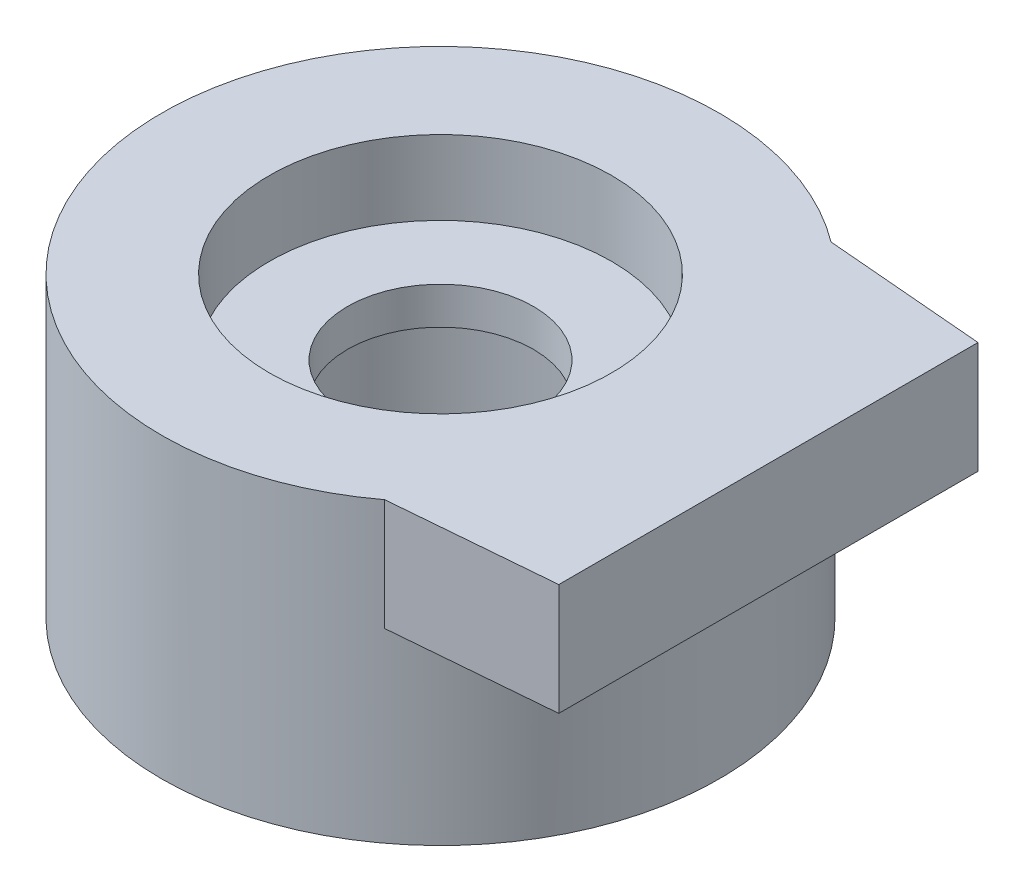
ISO-10303-21;
HEADER;
FILE_DESCRIPTION(('STEP AP214'),'2;1');
FILE_NAME('part.step','',(''),(''),'','','');
FILE_SCHEMA(('AUTOMOTIVE_DESIGN { 1 0 10303 214 1 1 1 1 }'));
ENDSEC;
DATA;
#1=APPLICATION_CONTEXT('core data for automotive mechanical design processes');
#2=APPLICATION_PROTOCOL_DEFINITION('international standard','automotive_design',2000,#1);
#3=PRODUCT_CONTEXT('',#1,'mechanical');
#4=PRODUCT('Part','Part','',(#3));
#5=PRODUCT_RELATED_PRODUCT_CATEGORY('part','',(#4));
#6=PRODUCT_DEFINITION_FORMATION('','',#4);
#7=PRODUCT_DEFINITION_CONTEXT('part definition',#1,'design');
#8=PRODUCT_DEFINITION('design','',#6,#7);
#9=PRODUCT_DEFINITION_SHAPE('','',#8);
#10=(LENGTH_UNIT() NAMED_UNIT(*) SI_UNIT(.MILLI.,.METRE.));
#11=(NAMED_UNIT(*) PLANE_ANGLE_UNIT() SI_UNIT($,.RADIAN.));
#12=(NAMED_UNIT(*) SI_UNIT($,.STERADIAN.) SOLID_ANGLE_UNIT());
#13=UNCERTAINTY_MEASURE_WITH_UNIT(LENGTH_MEASURE(1.E-05),#10,'distance_accuracy_value','');
#14=(GEOMETRIC_REPRESENTATION_CONTEXT(3) GLOBAL_UNCERTAINTY_ASSIGNED_CONTEXT((#13)) GLOBAL_UNIT_ASSIGNED_CONTEXT((#10,
#11,#12)) REPRESENTATION_CONTEXT('',''));
#15=CARTESIAN_POINT('',(0.,0.,0.));
#16=DIRECTION('',(0.,0.,1.));
#17=DIRECTION('',(1.,0.,0.));
#18=AXIS2_PLACEMENT_3D('',#15,#16,#17);
#19=CARTESIAN_POINT('',(0.,2.5,0.));
#20=DIRECTION('',(0.,-1.,0.));
#21=DIRECTION('',(0.,0.,-1.));
#22=AXIS2_PLACEMENT_3D('',#19,#20,#21);
#23=CYLINDRICAL_SURFACE('',#22,2.3);
#24=CARTESIAN_POINT('',(0.,0.,0.));
#25=DIRECTION('',(0.,-1.,0.));
#26=DIRECTION('',(0.,0.,-1.));
#27=AXIS2_PLACEMENT_3D('',#24,#25,#26);
#28=CIRCLE('',#27,2.3);
#29=CARTESIAN_POINT('',(0.,0.,-2.3));
#30=VERTEX_POINT('',#29);
#31=EDGE_CURVE('E11',#30,#30,#28,.T.);
#32=ORIENTED_EDGE('',*,*,#31,.T.);
#33=EDGE_LOOP('',(#32));
#34=FACE_BOUND('',#33,.T.);
#35=CARTESIAN_POINT('',(0.,2.5,0.));
#36=DIRECTION('',(0.,-1.,0.));
#37=DIRECTION('',(0.,0.,-1.));
#38=AXIS2_PLACEMENT_3D('',#35,#36,#37);
#39=CIRCLE('',#38,2.3);
#40=CARTESIAN_POINT('',(0.,2.5,-2.3));
#41=VERTEX_POINT('',#40);
#42=EDGE_CURVE('E72',#41,#41,#39,.T.);
#43=ORIENTED_EDGE('',*,*,#42,.F.);
#44=EDGE_LOOP('',(#43));
#45=FACE_BOUND('',#44,.T.);
#46=ADVANCED_FACE('F17',(#34,#45),#23,.F.);
#47=CARTESIAN_POINT('',(0.,3.,0.));
#48=DIRECTION('',(0.,1.,0.));
#49=DIRECTION('',(0.,0.,1.));
#50=AXIS2_PLACEMENT_3D('',#47,#48,#49);
#51=CYLINDRICAL_SURFACE('',#50,2.3);
#52=CARTESIAN_POINT('',(0.,4.,0.));
#53=DIRECTION('',(0.,1.,0.));
#54=DIRECTION('',(0.,0.,1.));
#55=AXIS2_PLACEMENT_3D('',#52,#53,#54);
#56=CIRCLE('',#55,2.3);
#57=CARTESIAN_POINT('',(0.,4.,2.3));
#58=VERTEX_POINT('',#57);
#59=EDGE_CURVE('E27',#58,#58,#56,.T.);
#60=ORIENTED_EDGE('',*,*,#59,.T.);
#61=EDGE_LOOP('',(#60));
#62=FACE_BOUND('',#61,.T.);
#63=CARTESIAN_POINT('',(0.,3.,0.));
#64=DIRECTION('',(0.,1.,0.));
#65=DIRECTION('',(0.,0.,1.));
#66=AXIS2_PLACEMENT_3D('',#63,#64,#65);
#67=CIRCLE('',#66,2.3);
#68=CARTESIAN_POINT('',(0.,3.,2.3));
#69=VERTEX_POINT('',#68);
#70=EDGE_CURVE('E90',#69,#69,#67,.T.);
#71=ORIENTED_EDGE('',*,*,#70,.F.);
#72=EDGE_LOOP('',(#71));
#73=FACE_BOUND('',#72,.T.);
#74=ADVANCED_FACE('F116',(#62,#73),#51,.F.);
#75=CARTESIAN_POINT('',(0.,4.,0.));
#76=DIRECTION('',(0.,-1.,0.));
#77=DIRECTION('',(0.,0.,-1.));
#78=AXIS2_PLACEMENT_3D('',#75,#76,#77);
#79=CYLINDRICAL_SURFACE('',#78,3.75);
#80=CARTESIAN_POINT('',(0.,0.,0.));
#81=DIRECTION('',(0.,1.,0.));
#82=DIRECTION('',(0.,0.,1.));
#83=AXIS2_PLACEMENT_3D('',#80,#81,#82);
#84=CIRCLE('',#83,3.75);
#85=CARTESIAN_POINT('',(0.,0.,3.75));
#86=VERTEX_POINT('',#85);
#87=EDGE_CURVE('E97',#86,#86,#84,.T.);
#88=ORIENTED_EDGE('',*,*,#87,.T.);
#89=EDGE_LOOP('',(#88));
#90=FACE_BOUND('',#89,.T.);
#91=CARTESIAN_POINT('',(0.,4.,0.));
#92=DIRECTION('',(0.,1.,0.));
#93=DIRECTION('',(0.,0.,1.));
#94=AXIS2_PLACEMENT_3D('',#91,#92,#93);
#95=CIRCLE('',#94,3.75);
#96=CARTESIAN_POINT('',(2.25,4.,-3.));
#97=VERTEX_POINT('',#96);
#98=CARTESIAN_POINT('',(2.25,4.,3.));
#99=VERTEX_POINT('',#98);
#100=EDGE_CURVE('E36',#97,#99,#95,.T.);
#101=ORIENTED_EDGE('',*,*,#100,.F.);
#102=DIRECTION('',(0.,1.,0.));
#103=VECTOR('',#102,1.);
#104=CARTESIAN_POINT('',(2.25,2.5,-3.));
#105=LINE('',#104,#103);
#106=CARTESIAN_POINT('',(2.25,2.5,-3.));
#107=VERTEX_POINT('',#106);
#108=EDGE_CURVE('E77',#107,#97,#105,.T.);
#109=ORIENTED_EDGE('',*,*,#108,.F.);
#110=CARTESIAN_POINT('',(0.,2.5,0.));
#111=DIRECTION('',(0.,-1.,0.));
#112=DIRECTION('',(0.,0.,-1.));
#113=AXIS2_PLACEMENT_3D('',#110,#111,#112);
#114=CIRCLE('',#113,3.75);
#115=CARTESIAN_POINT('',(2.25,2.5,3.));
#116=VERTEX_POINT('',#115);
#117=EDGE_CURVE('E99',#107,#116,#114,.T.);
#118=ORIENTED_EDGE('',*,*,#117,.T.);
#119=DIRECTION('',(0.,1.,0.));
#120=VECTOR('',#119,1.);
#121=CARTESIAN_POINT('',(2.25,2.5,3.));
#122=LINE('',#121,#120);
#123=EDGE_CURVE('E67',#116,#99,#122,.T.);
#124=ORIENTED_EDGE('',*,*,#123,.T.);
#125=EDGE_LOOP('',(#101,#109,#118,#124));
#126=FACE_BOUND('',#125,.T.);
#127=ADVANCED_FACE('F123',(#90,#126),#79,.T.);
#128=CARTESIAN_POINT('',(0.,-1.5,0.));
#129=DIRECTION('',(0.,1.,0.));
#130=DIRECTION('',(0.,0.,1.));
#131=AXIS2_PLACEMENT_3D('',#128,#129,#130);
#132=CYLINDRICAL_SURFACE('',#131,1.25);
#133=CARTESIAN_POINT('',(0.,3.,0.));
#134=DIRECTION('',(0.,1.,0.));
#135=DIRECTION('',(0.,0.,1.));
#136=AXIS2_PLACEMENT_3D('',#133,#134,#135);
#137=CIRCLE('',#136,1.25);
#138=CARTESIAN_POINT('',(0.,3.,1.25));
#139=VERTEX_POINT('',#138);
#140=EDGE_CURVE('E101',#139,#139,#137,.T.);
#141=ORIENTED_EDGE('',*,*,#140,.T.);
#142=EDGE_LOOP('',(#141));
#143=FACE_BOUND('',#142,.T.);
#144=CARTESIAN_POINT('',(0.,2.5,0.));
#145=DIRECTION('',(0.,1.,0.));
#146=DIRECTION('',(0.,0.,-1.));
#147=AXIS2_PLACEMENT_3D('',#144,#145,#146);
#148=CIRCLE('',#147,1.25);
#149=CARTESIAN_POINT('',(0.,2.5,-1.25));
#150=VERTEX_POINT('',#149);
#151=EDGE_CURVE('E81',#150,#150,#148,.T.);
#152=ORIENTED_EDGE('',*,*,#151,.F.);
#153=EDGE_LOOP('',(#152));
#154=FACE_BOUND('',#153,.T.);
#155=ADVANCED_FACE('F129',(#143,#154),#132,.F.);
#156=CARTESIAN_POINT('',(0.,4.,0.));
#157=DIRECTION('',(0.,1.,0.));
#158=DIRECTION('',(0.,0.,1.));
#159=AXIS2_PLACEMENT_3D('',#156,#157,#158);
#160=PLANE('',#159);
#161=DIRECTION('',(0.,0.,1.));
#162=VECTOR('',#161,1.);
#163=CARTESIAN_POINT('',(4.40776789419964,4.,2.81766907451634));
#164=LINE('',#163,#162);
#165=CARTESIAN_POINT('',(4.40776789419964,4.,-2.81766907451634));
#166=VERTEX_POINT('',#165);
#167=CARTESIAN_POINT('',(4.40776789419964,4.,2.81766907451634));
#168=VERTEX_POINT('',#167);
#169=EDGE_CURVE('E75',#166,#168,#164,.T.);
#170=ORIENTED_EDGE('',*,*,#169,.F.);
#171=DIRECTION('',(-0.996448898518601,0.,-0.0841997187707069));
#172=VECTOR('',#171,1.);
#173=CARTESIAN_POINT('',(14.1683994375414,4.,-1.9928977970372));
#174=LINE('',#173,#172);
#175=EDGE_CURVE('E104',#166,#97,#174,.T.);
#176=ORIENTED_EDGE('',*,*,#175,.T.);
#177=ORIENTED_EDGE('',*,*,#100,.T.);
#178=DIRECTION('',(0.996448898518601,0.,-0.0841997187707063));
#179=VECTOR('',#178,1.);
#180=CARTESIAN_POINT('',(14.1683994375414,4.,1.9928977970372));
#181=LINE('',#180,#179);
#182=EDGE_CURVE('E88',#99,#168,#181,.T.);
#183=ORIENTED_EDGE('',*,*,#182,.T.);
#184=EDGE_LOOP('',(#170,#176,#177,#183));
#185=FACE_BOUND('',#184,.T.);
#186=ORIENTED_EDGE('',*,*,#59,.F.);
#187=EDGE_LOOP('',(#186));
#188=FACE_BOUND('',#187,.T.);
#189=ADVANCED_FACE('F133',(#185,#188),#160,.T.);
#190=CARTESIAN_POINT('',(0.,0.,0.));
#191=DIRECTION('',(0.,1.,0.));
#192=DIRECTION('',(0.,0.,1.));
#193=AXIS2_PLACEMENT_3D('',#190,#191,#192);
#194=PLANE('',#193);
#195=ORIENTED_EDGE('',*,*,#31,.F.);
#196=EDGE_LOOP('',(#195));
#197=FACE_BOUND('',#196,.T.);
#198=ORIENTED_EDGE('',*,*,#87,.F.);
#199=EDGE_LOOP('',(#198));
#200=FACE_BOUND('',#199,.T.);
#201=ADVANCED_FACE('F137',(#197,#200),#194,.F.);
#202=CARTESIAN_POINT('',(0.,3.,0.));
#203=DIRECTION('',(0.,1.,0.));
#204=DIRECTION('',(0.,0.,1.));
#205=AXIS2_PLACEMENT_3D('',#202,#203,#204);
#206=PLANE('',#205);
#207=ORIENTED_EDGE('',*,*,#140,.F.);
#208=EDGE_LOOP('',(#207));
#209=FACE_BOUND('',#208,.T.);
#210=ORIENTED_EDGE('',*,*,#70,.T.);
#211=EDGE_LOOP('',(#210));
#212=FACE_BOUND('',#211,.T.);
#213=ADVANCED_FACE('F140',(#209,#212),#206,.T.);
#214=CARTESIAN_POINT('',(14.1683994375414,2.5,-1.9928977970372));
#215=DIRECTION('',(0.0841997187707069,0.,-0.996448898518601));
#216=DIRECTION('',(-0.996448898518601,0.,-0.0841997187707069));
#217=AXIS2_PLACEMENT_3D('',#214,#215,#216);
#218=PLANE('',#217);
#219=DIRECTION('',(0.,1.,0.));
#220=VECTOR('',#219,1.);
#221=CARTESIAN_POINT('',(4.40776789419964,0.,-2.81766907451634));
#222=LINE('',#221,#220);
#223=CARTESIAN_POINT('',(4.40776789419964,2.5,-2.81766907451634));
#224=VERTEX_POINT('',#223);
#225=EDGE_CURVE('E56',#224,#166,#222,.T.);
#226=ORIENTED_EDGE('',*,*,#225,.F.);
#227=DIRECTION('',(-0.996448898518601,0.,-0.0841997187707069));
#228=VECTOR('',#227,1.);
#229=CARTESIAN_POINT('',(14.1683994375414,2.5,-1.9928977970372));
#230=LINE('',#229,#228);
#231=EDGE_CURVE('E80',#224,#107,#230,.T.);
#232=ORIENTED_EDGE('',*,*,#231,.T.);
#233=ORIENTED_EDGE('',*,*,#108,.T.);
#234=ORIENTED_EDGE('',*,*,#175,.F.);
#235=EDGE_LOOP('',(#226,#232,#233,#234));
#236=FACE_BOUND('',#235,.T.);
#237=ADVANCED_FACE('F144',(#236),#218,.T.);
#238=CARTESIAN_POINT('',(14.1683994375414,2.5,1.9928977970372));
#239=DIRECTION('',(0.0841997187707063,0.,0.996448898518601));
#240=DIRECTION('',(0.996448898518601,0.,-0.0841997187707063));
#241=AXIS2_PLACEMENT_3D('',#238,#239,#240);
#242=PLANE('',#241);
#243=DIRECTION('',(0.,1.,0.));
#244=VECTOR('',#243,1.);
#245=CARTESIAN_POINT('',(4.40776789419964,0.,2.81766907451634));
#246=LINE('',#245,#244);
#247=CARTESIAN_POINT('',(4.40776789419964,2.5,2.81766907451634));
#248=VERTEX_POINT('',#247);
#249=EDGE_CURVE('E66',#248,#168,#246,.T.);
#250=ORIENTED_EDGE('',*,*,#249,.T.);
#251=ORIENTED_EDGE('',*,*,#182,.F.);
#252=ORIENTED_EDGE('',*,*,#123,.F.);
#253=DIRECTION('',(0.996448898518601,0.,-0.0841997187707063));
#254=VECTOR('',#253,1.);
#255=CARTESIAN_POINT('',(14.1683994375414,2.5,1.9928977970372));
#256=LINE('',#255,#254);
#257=EDGE_CURVE('E62',#116,#248,#256,.T.);
#258=ORIENTED_EDGE('',*,*,#257,.T.);
#259=EDGE_LOOP('',(#250,#251,#252,#258));
#260=FACE_BOUND('',#259,.T.);
#261=ADVANCED_FACE('F64',(#260),#242,.T.);
#262=CARTESIAN_POINT('',(0.,2.5,0.));
#263=DIRECTION('',(0.,-1.,0.));
#264=DIRECTION('',(0.,0.,-1.));
#265=AXIS2_PLACEMENT_3D('',#262,#263,#264);
#266=PLANE('',#265);
#267=DIRECTION('',(0.,0.,-1.));
#268=VECTOR('',#267,1.);
#269=CARTESIAN_POINT('',(4.40776789419964,2.5,0.));
#270=LINE('',#269,#268);
#271=EDGE_CURVE('E21',#248,#224,#270,.T.);
#272=ORIENTED_EDGE('',*,*,#271,.F.);
#273=ORIENTED_EDGE('',*,*,#257,.F.);
#274=ORIENTED_EDGE('',*,*,#117,.F.);
#275=ORIENTED_EDGE('',*,*,#231,.F.);
#276=EDGE_LOOP('',(#272,#273,#274,#275));
#277=FACE_BOUND('',#276,.T.);
#278=ADVANCED_FACE('F79',(#277),#266,.T.);
#279=CARTESIAN_POINT('',(0.,2.5,0.));
#280=DIRECTION('',(0.,-1.,0.));
#281=DIRECTION('',(0.,0.,-1.));
#282=AXIS2_PLACEMENT_3D('',#279,#280,#281);
#283=PLANE('',#282);
#284=ORIENTED_EDGE('',*,*,#42,.T.);
#285=EDGE_LOOP('',(#284));
#286=FACE_BOUND('',#285,.T.);
#287=ORIENTED_EDGE('',*,*,#151,.T.);
#288=EDGE_LOOP('',(#287));
#289=FACE_BOUND('',#288,.T.);
#290=ADVANCED_FACE('F112',(#286,#289),#283,.T.);
#291=CARTESIAN_POINT('',(4.40776789419964,0.,2.81766907451634));
#292=DIRECTION('',(-1.,0.,0.));
#293=DIRECTION('',(0.,0.,1.));
#294=AXIS2_PLACEMENT_3D('',#291,#292,#293);
#295=PLANE('',#294);
#296=ORIENTED_EDGE('',*,*,#271,.T.);
#297=ORIENTED_EDGE('',*,*,#225,.T.);
#298=ORIENTED_EDGE('',*,*,#169,.T.);
#299=ORIENTED_EDGE('',*,*,#249,.F.);
#300=EDGE_LOOP('',(#296,#297,#298,#299));
#301=FACE_BOUND('',#300,.T.);
#302=ADVANCED_FACE('F19',(#301),#295,.F.);
#303=CLOSED_SHELL('',(#46,#74,#127,#155,#189,#201,#213,#237,#261,#278,#290,#302));
#304=MANIFOLD_SOLID_BREP('B1',#303);
#305=ADVANCED_BREP_SHAPE_REPRESENTATION('',(#18,#304),#14);
#306=SHAPE_DEFINITION_REPRESENTATION(#9,#305);
ENDSEC;
END-ISO-10303-21;
